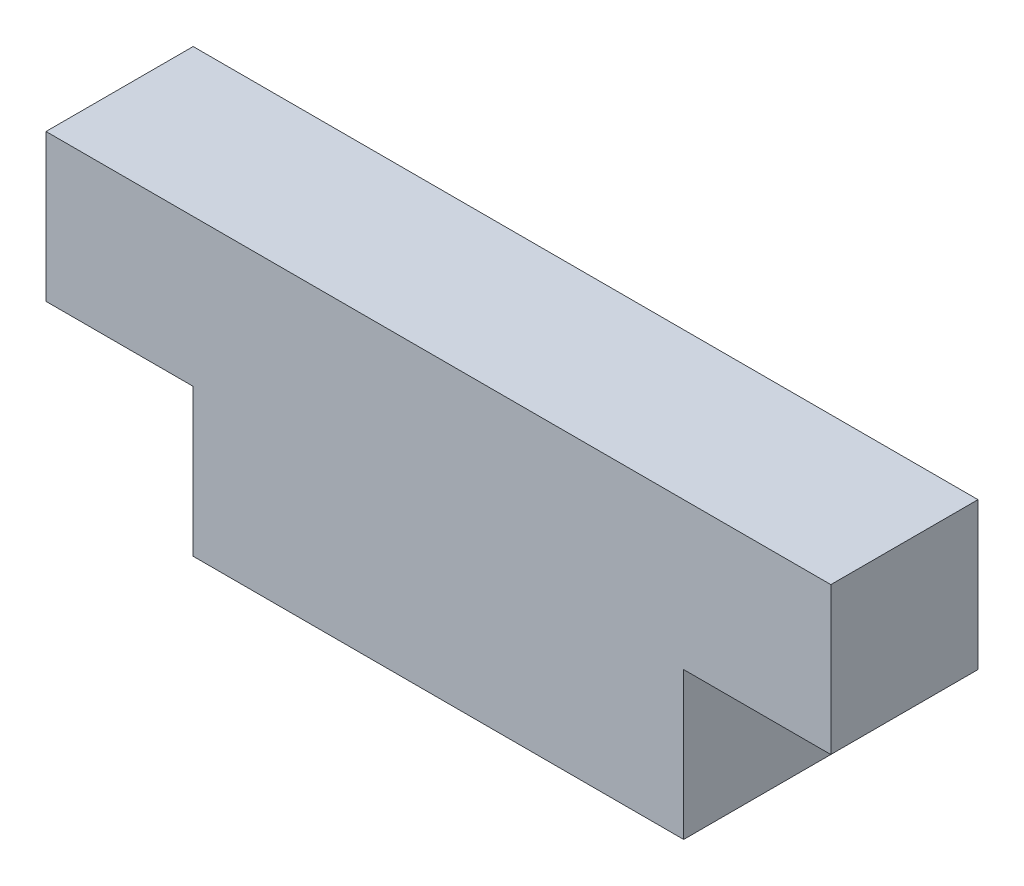
ISO-10303-21;
HEADER;
FILE_DESCRIPTION(('STEP AP214'),'2;1');
FILE_NAME('part.step','',(''),(''),'','','');
FILE_SCHEMA(('AUTOMOTIVE_DESIGN { 1 0 10303 214 1 1 1 1 }'));
ENDSEC;
DATA;
#1=APPLICATION_CONTEXT('core data for automotive mechanical design processes');
#2=APPLICATION_PROTOCOL_DEFINITION('international standard','automotive_design',2000,#1);
#3=PRODUCT_CONTEXT('',#1,'mechanical');
#4=PRODUCT('Part','Part','',(#3));
#5=PRODUCT_RELATED_PRODUCT_CATEGORY('part','',(#4));
#6=PRODUCT_DEFINITION_FORMATION('','',#4);
#7=PRODUCT_DEFINITION_CONTEXT('part definition',#1,'design');
#8=PRODUCT_DEFINITION('design','',#6,#7);
#9=PRODUCT_DEFINITION_SHAPE('','',#8);
#10=(LENGTH_UNIT() NAMED_UNIT(*) SI_UNIT(.MILLI.,.METRE.));
#11=(NAMED_UNIT(*) PLANE_ANGLE_UNIT() SI_UNIT($,.RADIAN.));
#12=(NAMED_UNIT(*) SI_UNIT($,.STERADIAN.) SOLID_ANGLE_UNIT());
#13=UNCERTAINTY_MEASURE_WITH_UNIT(LENGTH_MEASURE(1.E-05),#10,'distance_accuracy_value','');
#14=(GEOMETRIC_REPRESENTATION_CONTEXT(3) GLOBAL_UNCERTAINTY_ASSIGNED_CONTEXT((#13)) GLOBAL_UNIT_ASSIGNED_CONTEXT((#10,
#11,#12)) REPRESENTATION_CONTEXT('',''));
#15=CARTESIAN_POINT('',(0.,0.,0.));
#16=DIRECTION('',(0.,0.,1.));
#17=DIRECTION('',(1.,0.,0.));
#18=AXIS2_PLACEMENT_3D('',#15,#16,#17);
#19=CARTESIAN_POINT('',(-5.,3.,1.5));
#20=DIRECTION('',(1.,0.,0.));
#21=DIRECTION('',(0.,0.,-1.));
#22=AXIS2_PLACEMENT_3D('',#19,#20,#21);
#23=PLANE('',#22);
#24=DIRECTION('',(0.,0.,1.));
#25=VECTOR('',#24,1.);
#26=CARTESIAN_POINT('',(-5.,0.,1.5));
#27=LINE('',#26,#25);
#28=CARTESIAN_POINT('',(-5.,0.,-1.5));
#29=VERTEX_POINT('',#28);
#30=CARTESIAN_POINT('',(-5.,0.,1.5));
#31=VERTEX_POINT('',#30);
#32=EDGE_CURVE('E139',#29,#31,#27,.T.);
#33=ORIENTED_EDGE('',*,*,#32,.T.);
#34=DIRECTION('',(0.,-1.,0.));
#35=VECTOR('',#34,1.);
#36=CARTESIAN_POINT('',(-5.,3.,1.5));
#37=LINE('',#36,#35);
#38=CARTESIAN_POINT('',(-5.,3.,1.5));
#39=VERTEX_POINT('',#38);
#40=EDGE_CURVE('E11',#39,#31,#37,.T.);
#41=ORIENTED_EDGE('',*,*,#40,.F.);
#42=DIRECTION('',(0.,0.,1.));
#43=VECTOR('',#42,1.);
#44=CARTESIAN_POINT('',(-5.,3.,1.5));
#45=LINE('',#44,#43);
#46=CARTESIAN_POINT('',(-5.,3.,-1.5));
#47=VERTEX_POINT('',#46);
#48=EDGE_CURVE('E149',#47,#39,#45,.T.);
#49=ORIENTED_EDGE('',*,*,#48,.F.);
#50=DIRECTION('',(0.,-1.,0.));
#51=VECTOR('',#50,1.);
#52=CARTESIAN_POINT('',(-5.,3.,-1.5));
#53=LINE('',#52,#51);
#54=EDGE_CURVE('E56',#47,#29,#53,.T.);
#55=ORIENTED_EDGE('',*,*,#54,.T.);
#56=EDGE_LOOP('',(#33,#41,#49,#55));
#57=FACE_BOUND('',#56,.T.);
#58=ADVANCED_FACE('F39',(#57),#23,.F.);
#59=CARTESIAN_POINT('',(5.,3.,1.5));
#60=DIRECTION('',(0.,0.,-1.));
#61=DIRECTION('',(-1.,0.,0.));
#62=AXIS2_PLACEMENT_3D('',#59,#60,#61);
#63=PLANE('',#62);
#64=DIRECTION('',(1.,0.,0.));
#65=VECTOR('',#64,1.);
#66=CARTESIAN_POINT('',(5.,0.,1.5));
#67=LINE('',#66,#65);
#68=CARTESIAN_POINT('',(5.,0.,1.5));
#69=VERTEX_POINT('',#68);
#70=EDGE_CURVE('E143',#31,#69,#67,.T.);
#71=ORIENTED_EDGE('',*,*,#70,.T.);
#72=DIRECTION('',(0.,-1.,0.));
#73=VECTOR('',#72,1.);
#74=CARTESIAN_POINT('',(5.,3.,1.5));
#75=LINE('',#74,#73);
#76=CARTESIAN_POINT('',(5.,3.,1.5));
#77=VERTEX_POINT('',#76);
#78=EDGE_CURVE('E48',#77,#69,#75,.T.);
#79=ORIENTED_EDGE('',*,*,#78,.F.);
#80=DIRECTION('',(1.,0.,0.));
#81=VECTOR('',#80,1.);
#82=CARTESIAN_POINT('',(8.,3.,1.5));
#83=LINE('',#82,#81);
#84=CARTESIAN_POINT('',(8.,3.,1.5));
#85=VERTEX_POINT('',#84);
#86=EDGE_CURVE('E198',#77,#85,#83,.T.);
#87=ORIENTED_EDGE('',*,*,#86,.T.);
#88=DIRECTION('',(0.,-1.,0.));
#89=VECTOR('',#88,1.);
#90=CARTESIAN_POINT('',(8.,6.,1.5));
#91=LINE('',#90,#89);
#92=CARTESIAN_POINT('',(8.,6.,1.5));
#93=VERTEX_POINT('',#92);
#94=EDGE_CURVE('E118',#93,#85,#91,.T.);
#95=ORIENTED_EDGE('',*,*,#94,.F.);
#96=DIRECTION('',(1.,0.,0.));
#97=VECTOR('',#96,1.);
#98=CARTESIAN_POINT('',(8.,6.,1.5));
#99=LINE('',#98,#97);
#100=CARTESIAN_POINT('',(-8.,6.,1.5));
#101=VERTEX_POINT('',#100);
#102=EDGE_CURVE('E110',#101,#93,#99,.T.);
#103=ORIENTED_EDGE('',*,*,#102,.F.);
#104=DIRECTION('',(0.,-1.,0.));
#105=VECTOR('',#104,1.);
#106=CARTESIAN_POINT('',(-8.,6.,1.5));
#107=LINE('',#106,#105);
#108=CARTESIAN_POINT('',(-8.,3.,1.5));
#109=VERTEX_POINT('',#108);
#110=EDGE_CURVE('E115',#101,#109,#107,.T.);
#111=ORIENTED_EDGE('',*,*,#110,.T.);
#112=EDGE_CURVE('E183',#109,#39,#83,.T.);
#113=ORIENTED_EDGE('',*,*,#112,.T.);
#114=ORIENTED_EDGE('',*,*,#40,.T.);
#115=EDGE_LOOP('',(#71,#79,#87,#95,#103,#111,#113,#114));
#116=FACE_BOUND('',#115,.T.);
#117=ADVANCED_FACE('F112',(#116),#63,.F.);
#118=CARTESIAN_POINT('',(5.,3.,1.5));
#119=DIRECTION('',(-1.,0.,0.));
#120=DIRECTION('',(0.,0.,1.));
#121=AXIS2_PLACEMENT_3D('',#118,#119,#120);
#122=PLANE('',#121);
#123=DIRECTION('',(0.,0.,-1.));
#124=VECTOR('',#123,1.);
#125=CARTESIAN_POINT('',(5.,0.,1.5));
#126=LINE('',#125,#124);
#127=CARTESIAN_POINT('',(5.,0.,-1.5));
#128=VERTEX_POINT('',#127);
#129=EDGE_CURVE('E75',#69,#128,#126,.T.);
#130=ORIENTED_EDGE('',*,*,#129,.T.);
#131=DIRECTION('',(0.,-1.,0.));
#132=VECTOR('',#131,1.);
#133=CARTESIAN_POINT('',(5.,3.,-1.5));
#134=LINE('',#133,#132);
#135=CARTESIAN_POINT('',(5.,3.,-1.5));
#136=VERTEX_POINT('',#135);
#137=EDGE_CURVE('E164',#136,#128,#134,.T.);
#138=ORIENTED_EDGE('',*,*,#137,.F.);
#139=DIRECTION('',(0.,0.,-1.));
#140=VECTOR('',#139,1.);
#141=CARTESIAN_POINT('',(5.,3.,1.5));
#142=LINE('',#141,#140);
#143=EDGE_CURVE('E152',#77,#136,#142,.T.);
#144=ORIENTED_EDGE('',*,*,#143,.F.);
#145=ORIENTED_EDGE('',*,*,#78,.T.);
#146=EDGE_LOOP('',(#130,#138,#144,#145));
#147=FACE_BOUND('',#146,.T.);
#148=ADVANCED_FACE('F168',(#147),#122,.F.);
#149=CARTESIAN_POINT('',(5.,3.,-1.5));
#150=DIRECTION('',(0.,0.,1.));
#151=DIRECTION('',(1.,0.,0.));
#152=AXIS2_PLACEMENT_3D('',#149,#150,#151);
#153=PLANE('',#152);
#154=DIRECTION('',(-1.,0.,0.));
#155=VECTOR('',#154,1.);
#156=CARTESIAN_POINT('',(5.,0.,-1.5));
#157=LINE('',#156,#155);
#158=EDGE_CURVE('E78',#128,#29,#157,.T.);
#159=ORIENTED_EDGE('',*,*,#158,.T.);
#160=ORIENTED_EDGE('',*,*,#54,.F.);
#161=DIRECTION('',(-1.,0.,0.));
#162=VECTOR('',#161,1.);
#163=CARTESIAN_POINT('',(8.,3.,-1.5));
#164=LINE('',#163,#162);
#165=CARTESIAN_POINT('',(-8.,3.,-1.5));
#166=VERTEX_POINT('',#165);
#167=EDGE_CURVE('E175',#47,#166,#164,.T.);
#168=ORIENTED_EDGE('',*,*,#167,.T.);
#169=DIRECTION('',(0.,-1.,0.));
#170=VECTOR('',#169,1.);
#171=CARTESIAN_POINT('',(-8.,6.,-1.5));
#172=LINE('',#171,#170);
#173=CARTESIAN_POINT('',(-8.,6.,-1.5));
#174=VERTEX_POINT('',#173);
#175=EDGE_CURVE('E187',#174,#166,#172,.T.);
#176=ORIENTED_EDGE('',*,*,#175,.F.);
#177=DIRECTION('',(-1.,0.,0.));
#178=VECTOR('',#177,1.);
#179=CARTESIAN_POINT('',(8.,6.,-1.5));
#180=LINE('',#179,#178);
#181=CARTESIAN_POINT('',(8.,6.,-1.5));
#182=VERTEX_POINT('',#181);
#183=EDGE_CURVE('E128',#182,#174,#180,.T.);
#184=ORIENTED_EDGE('',*,*,#183,.F.);
#185=DIRECTION('',(0.,-1.,0.));
#186=VECTOR('',#185,1.);
#187=CARTESIAN_POINT('',(8.,6.,-1.5));
#188=LINE('',#187,#186);
#189=CARTESIAN_POINT('',(8.,3.,-1.5));
#190=VERTEX_POINT('',#189);
#191=EDGE_CURVE('E145',#182,#190,#188,.T.);
#192=ORIENTED_EDGE('',*,*,#191,.T.);
#193=EDGE_CURVE('E133',#190,#136,#164,.T.);
#194=ORIENTED_EDGE('',*,*,#193,.T.);
#195=ORIENTED_EDGE('',*,*,#137,.T.);
#196=EDGE_LOOP('',(#159,#160,#168,#176,#184,#192,#194,#195));
#197=FACE_BOUND('',#196,.T.);
#198=ADVANCED_FACE('F193',(#197),#153,.F.);
#199=CARTESIAN_POINT('',(0.,0.,0.));
#200=DIRECTION('',(0.,1.,0.));
#201=DIRECTION('',(0.,0.,1.));
#202=AXIS2_PLACEMENT_3D('',#199,#200,#201);
#203=PLANE('',#202);
#204=ORIENTED_EDGE('',*,*,#32,.F.);
#205=ORIENTED_EDGE('',*,*,#158,.F.);
#206=ORIENTED_EDGE('',*,*,#129,.F.);
#207=ORIENTED_EDGE('',*,*,#70,.F.);
#208=EDGE_LOOP('',(#204,#205,#206,#207));
#209=FACE_BOUND('',#208,.T.);
#210=ADVANCED_FACE('F172',(#209),#203,.F.);
#211=CARTESIAN_POINT('',(0.,3.,0.));
#212=DIRECTION('',(0.,1.,0.));
#213=DIRECTION('',(0.,0.,1.));
#214=AXIS2_PLACEMENT_3D('',#211,#212,#213);
#215=PLANE('',#214);
#216=ORIENTED_EDGE('',*,*,#167,.F.);
#217=ORIENTED_EDGE('',*,*,#48,.T.);
#218=ORIENTED_EDGE('',*,*,#112,.F.);
#219=DIRECTION('',(0.,0.,1.));
#220=VECTOR('',#219,1.);
#221=CARTESIAN_POINT('',(-8.,3.,1.5));
#222=LINE('',#221,#220);
#223=EDGE_CURVE('E137',#166,#109,#222,.T.);
#224=ORIENTED_EDGE('',*,*,#223,.F.);
#225=EDGE_LOOP('',(#216,#217,#218,#224));
#226=FACE_BOUND('',#225,.T.);
#227=ADVANCED_FACE('F176',(#226),#215,.F.);
#228=ORIENTED_EDGE('',*,*,#86,.F.);
#229=ORIENTED_EDGE('',*,*,#143,.T.);
#230=ORIENTED_EDGE('',*,*,#193,.F.);
#231=DIRECTION('',(0.,0.,-1.));
#232=VECTOR('',#231,1.);
#233=CARTESIAN_POINT('',(8.,3.,1.5));
#234=LINE('',#233,#232);
#235=EDGE_CURVE('E178',#85,#190,#234,.T.);
#236=ORIENTED_EDGE('',*,*,#235,.F.);
#237=EDGE_LOOP('',(#228,#229,#230,#236));
#238=FACE_BOUND('',#237,.T.);
#239=ADVANCED_FACE('F197',(#238),#215,.F.);
#240=CARTESIAN_POINT('',(-8.,6.,1.5));
#241=DIRECTION('',(1.,0.,0.));
#242=DIRECTION('',(0.,0.,-1.));
#243=AXIS2_PLACEMENT_3D('',#240,#241,#242);
#244=PLANE('',#243);
#245=ORIENTED_EDGE('',*,*,#223,.T.);
#246=ORIENTED_EDGE('',*,*,#110,.F.);
#247=DIRECTION('',(0.,0.,1.));
#248=VECTOR('',#247,1.);
#249=CARTESIAN_POINT('',(-8.,6.,1.5));
#250=LINE('',#249,#248);
#251=EDGE_CURVE('E123',#174,#101,#250,.T.);
#252=ORIENTED_EDGE('',*,*,#251,.F.);
#253=ORIENTED_EDGE('',*,*,#175,.T.);
#254=EDGE_LOOP('',(#245,#246,#252,#253));
#255=FACE_BOUND('',#254,.T.);
#256=ADVANCED_FACE('F135',(#255),#244,.F.);
#257=CARTESIAN_POINT('',(8.,6.,1.5));
#258=DIRECTION('',(-1.,0.,0.));
#259=DIRECTION('',(0.,0.,1.));
#260=AXIS2_PLACEMENT_3D('',#257,#258,#259);
#261=PLANE('',#260);
#262=ORIENTED_EDGE('',*,*,#235,.T.);
#263=ORIENTED_EDGE('',*,*,#191,.F.);
#264=DIRECTION('',(0.,0.,-1.));
#265=VECTOR('',#264,1.);
#266=CARTESIAN_POINT('',(8.,6.,1.5));
#267=LINE('',#266,#265);
#268=EDGE_CURVE('E122',#93,#182,#267,.T.);
#269=ORIENTED_EDGE('',*,*,#268,.F.);
#270=ORIENTED_EDGE('',*,*,#94,.T.);
#271=EDGE_LOOP('',(#262,#263,#269,#270));
#272=FACE_BOUND('',#271,.T.);
#273=ADVANCED_FACE('F207',(#272),#261,.F.);
#274=CARTESIAN_POINT('',(0.,6.,0.));
#275=DIRECTION('',(0.,1.,0.));
#276=DIRECTION('',(0.,0.,1.));
#277=AXIS2_PLACEMENT_3D('',#274,#275,#276);
#278=PLANE('',#277);
#279=ORIENTED_EDGE('',*,*,#251,.T.);
#280=ORIENTED_EDGE('',*,*,#102,.T.);
#281=ORIENTED_EDGE('',*,*,#268,.T.);
#282=ORIENTED_EDGE('',*,*,#183,.T.);
#283=EDGE_LOOP('',(#279,#280,#281,#282));
#284=FACE_BOUND('',#283,.T.);
#285=ADVANCED_FACE('F126',(#284),#278,.T.);
#286=CLOSED_SHELL('',(#58,#117,#148,#198,#210,#227,#239,#256,#273,#285));
#287=MANIFOLD_SOLID_BREP('B2',#286);
#288=ADVANCED_BREP_SHAPE_REPRESENTATION('',(#18,#287),#14);
#289=SHAPE_DEFINITION_REPRESENTATION(#9,#288);
ENDSEC;
END-ISO-10303-21;
